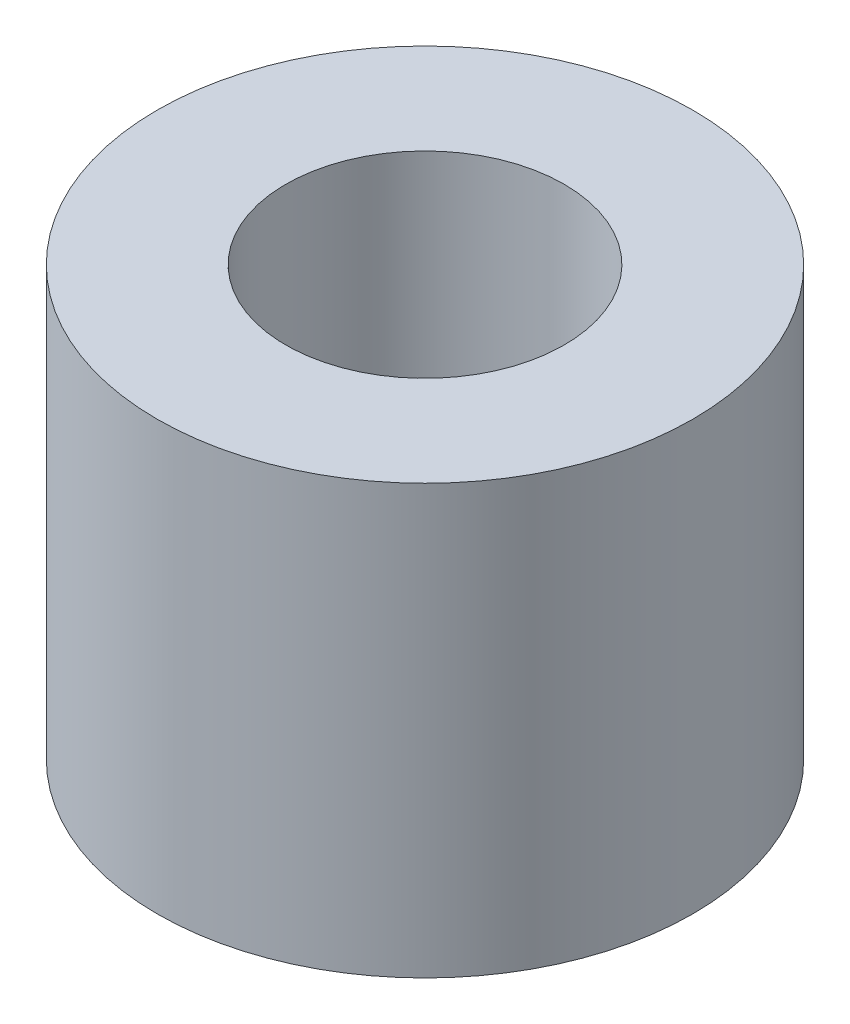
ISO-10303-21;
HEADER;
FILE_DESCRIPTION(('STEP AP214'),'2;1');
FILE_NAME('part.step','',(''),(''),'','','');
FILE_SCHEMA(('AUTOMOTIVE_DESIGN { 1 0 10303 214 1 1 1 1 }'));
ENDSEC;
DATA;
#1=APPLICATION_CONTEXT('core data for automotive mechanical design processes');
#2=APPLICATION_PROTOCOL_DEFINITION('international standard','automotive_design',2000,#1);
#3=PRODUCT_CONTEXT('',#1,'mechanical');
#4=PRODUCT('Part','Part','',(#3));
#5=PRODUCT_RELATED_PRODUCT_CATEGORY('part','',(#4));
#6=PRODUCT_DEFINITION_FORMATION('','',#4);
#7=PRODUCT_DEFINITION_CONTEXT('part definition',#1,'design');
#8=PRODUCT_DEFINITION('design','',#6,#7);
#9=PRODUCT_DEFINITION_SHAPE('','',#8);
#10=(LENGTH_UNIT() NAMED_UNIT(*) SI_UNIT(.MILLI.,.METRE.));
#11=(NAMED_UNIT(*) PLANE_ANGLE_UNIT() SI_UNIT($,.RADIAN.));
#12=(NAMED_UNIT(*) SI_UNIT($,.STERADIAN.) SOLID_ANGLE_UNIT());
#13=UNCERTAINTY_MEASURE_WITH_UNIT(LENGTH_MEASURE(1.E-05),#10,'distance_accuracy_value','');
#14=(GEOMETRIC_REPRESENTATION_CONTEXT(3) GLOBAL_UNCERTAINTY_ASSIGNED_CONTEXT((#13)) GLOBAL_UNIT_ASSIGNED_CONTEXT((#10,
#11,#12)) REPRESENTATION_CONTEXT('',''));
#15=CARTESIAN_POINT('',(0.,0.,0.));
#16=DIRECTION('',(0.,0.,1.));
#17=DIRECTION('',(1.,0.,0.));
#18=AXIS2_PLACEMENT_3D('',#15,#16,#17);
#19=CARTESIAN_POINT('',(0.,8.,0.));
#20=DIRECTION('',(0.,-1.,0.));
#21=DIRECTION('',(0.,0.,-1.));
#22=AXIS2_PLACEMENT_3D('',#19,#20,#21);
#23=CYLINDRICAL_SURFACE('',#22,5.);
#24=CARTESIAN_POINT('',(0.,8.,0.));
#25=DIRECTION('',(0.,-1.,0.));
#26=DIRECTION('',(0.,0.,-1.));
#27=AXIS2_PLACEMENT_3D('',#24,#25,#26);
#28=CIRCLE('',#27,5.);
#29=CARTESIAN_POINT('',(0.,8.,-5.));
#30=VERTEX_POINT('',#29);
#31=EDGE_CURVE('E10',#30,#30,#28,.T.);
#32=ORIENTED_EDGE('',*,*,#31,.T.);
#33=EDGE_LOOP('',(#32));
#34=FACE_BOUND('',#33,.T.);
#35=CARTESIAN_POINT('',(0.,0.,0.));
#36=DIRECTION('',(0.,-1.,0.));
#37=DIRECTION('',(0.,0.,-1.));
#38=AXIS2_PLACEMENT_3D('',#35,#36,#37);
#39=CIRCLE('',#38,5.);
#40=CARTESIAN_POINT('',(0.,0.,-5.));
#41=VERTEX_POINT('',#40);
#42=EDGE_CURVE('E45',#41,#41,#39,.T.);
#43=ORIENTED_EDGE('',*,*,#42,.F.);
#44=EDGE_LOOP('',(#43));
#45=FACE_BOUND('',#44,.T.);
#46=ADVANCED_FACE('F31',(#34,#45),#23,.T.);
#47=CARTESIAN_POINT('',(5.,8.,0.));
#48=DIRECTION('',(0.,1.,0.));
#49=DIRECTION('',(0.,0.,1.));
#50=AXIS2_PLACEMENT_3D('',#47,#48,#49);
#51=PLANE('',#50);
#52=CARTESIAN_POINT('',(0.,8.,0.));
#53=DIRECTION('',(0.,-1.,0.));
#54=DIRECTION('',(0.,0.,-1.));
#55=AXIS2_PLACEMENT_3D('',#52,#53,#54);
#56=CIRCLE('',#55,2.6);
#57=CARTESIAN_POINT('',(0.,8.,-2.6));
#58=VERTEX_POINT('',#57);
#59=EDGE_CURVE('E37',#58,#58,#56,.T.);
#60=ORIENTED_EDGE('',*,*,#59,.T.);
#61=EDGE_LOOP('',(#60));
#62=FACE_BOUND('',#61,.T.);
#63=ORIENTED_EDGE('',*,*,#31,.F.);
#64=EDGE_LOOP('',(#63));
#65=FACE_BOUND('',#64,.T.);
#66=ADVANCED_FACE('F55',(#62,#65),#51,.T.);
#67=CARTESIAN_POINT('',(0.,8.,0.));
#68=DIRECTION('',(0.,-1.,0.));
#69=DIRECTION('',(0.,0.,-1.));
#70=AXIS2_PLACEMENT_3D('',#67,#68,#69);
#71=CYLINDRICAL_SURFACE('',#70,2.6);
#72=CARTESIAN_POINT('',(0.,0.,0.));
#73=DIRECTION('',(0.,-1.,0.));
#74=DIRECTION('',(0.,0.,-1.));
#75=AXIS2_PLACEMENT_3D('',#72,#73,#74);
#76=CIRCLE('',#75,2.6);
#77=CARTESIAN_POINT('',(0.,0.,-2.6));
#78=VERTEX_POINT('',#77);
#79=EDGE_CURVE('E41',#78,#78,#76,.T.);
#80=ORIENTED_EDGE('',*,*,#79,.T.);
#81=EDGE_LOOP('',(#80));
#82=FACE_BOUND('',#81,.T.);
#83=ORIENTED_EDGE('',*,*,#59,.F.);
#84=EDGE_LOOP('',(#83));
#85=FACE_BOUND('',#84,.T.);
#86=ADVANCED_FACE('F59',(#82,#85),#71,.F.);
#87=CARTESIAN_POINT('',(2.6,0.,0.));
#88=DIRECTION('',(0.,-1.,0.));
#89=DIRECTION('',(0.,0.,-1.));
#90=AXIS2_PLACEMENT_3D('',#87,#88,#89);
#91=PLANE('',#90);
#92=ORIENTED_EDGE('',*,*,#42,.T.);
#93=EDGE_LOOP('',(#92));
#94=FACE_BOUND('',#93,.T.);
#95=ORIENTED_EDGE('',*,*,#79,.F.);
#96=EDGE_LOOP('',(#95));
#97=FACE_BOUND('',#96,.T.);
#98=ADVANCED_FACE('F51',(#94,#97),#91,.T.);
#99=CLOSED_SHELL('',(#46,#66,#86,#98));
#100=MANIFOLD_SOLID_BREP('B2',#99);
#101=ADVANCED_BREP_SHAPE_REPRESENTATION('',(#18,#100),#14);
#102=SHAPE_DEFINITION_REPRESENTATION(#9,#101);
ENDSEC;
END-ISO-10303-21;
